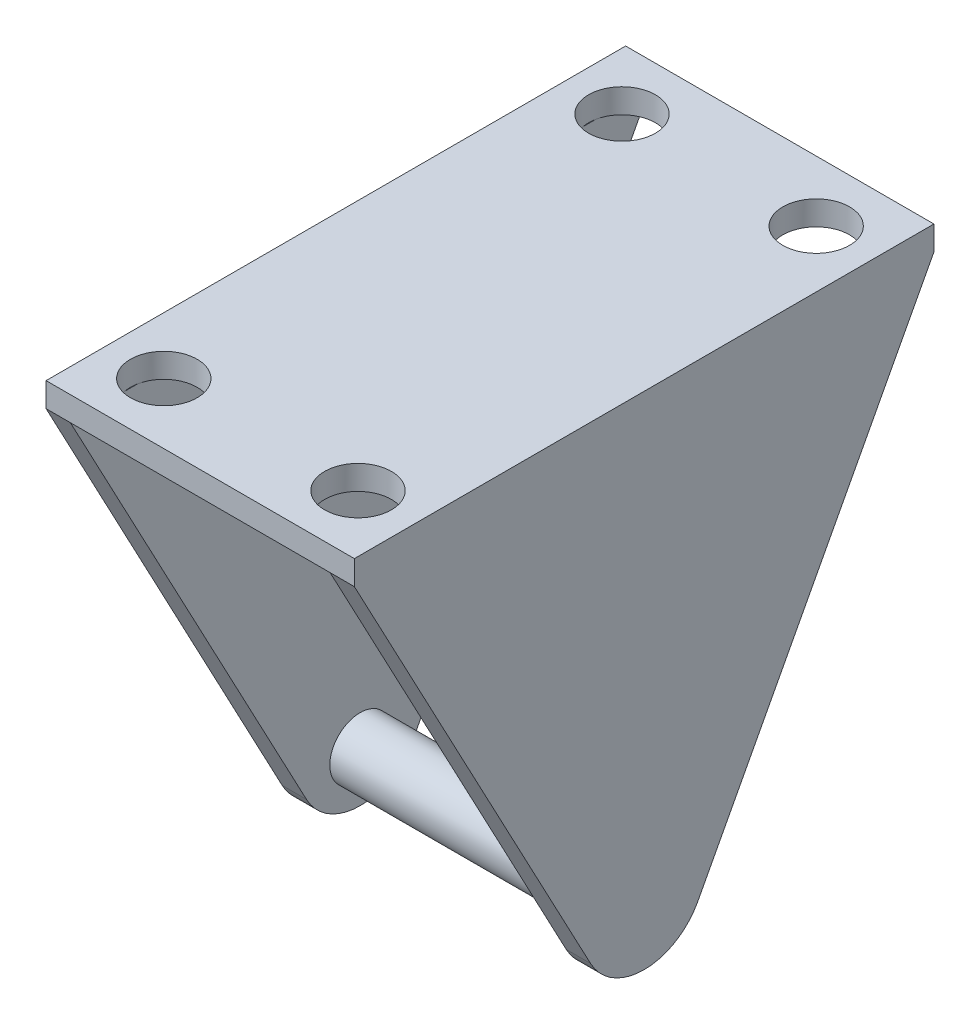
ISO-10303-21;
HEADER;
FILE_DESCRIPTION(('STEP AP214'),'2;1');
FILE_NAME('part.step','',(''),(''),'','','');
FILE_SCHEMA(('AUTOMOTIVE_DESIGN { 1 0 10303 214 1 1 1 1 }'));
ENDSEC;
DATA;
#1=APPLICATION_CONTEXT('core data for automotive mechanical design processes');
#2=APPLICATION_PROTOCOL_DEFINITION('international standard','automotive_design',2000,#1);
#3=PRODUCT_CONTEXT('',#1,'mechanical');
#4=PRODUCT('Part','Part','',(#3));
#5=PRODUCT_RELATED_PRODUCT_CATEGORY('part','',(#4));
#6=PRODUCT_DEFINITION_FORMATION('','',#4);
#7=PRODUCT_DEFINITION_CONTEXT('part definition',#1,'design');
#8=PRODUCT_DEFINITION('design','',#6,#7);
#9=PRODUCT_DEFINITION_SHAPE('','',#8);
#10=(LENGTH_UNIT() NAMED_UNIT(*) SI_UNIT(.MILLI.,.METRE.));
#11=(NAMED_UNIT(*) PLANE_ANGLE_UNIT() SI_UNIT($,.RADIAN.));
#12=(NAMED_UNIT(*) SI_UNIT($,.STERADIAN.) SOLID_ANGLE_UNIT());
#13=UNCERTAINTY_MEASURE_WITH_UNIT(LENGTH_MEASURE(1.E-05),#10,'distance_accuracy_value','');
#14=(GEOMETRIC_REPRESENTATION_CONTEXT(3) GLOBAL_UNCERTAINTY_ASSIGNED_CONTEXT((#13)) GLOBAL_UNIT_ASSIGNED_CONTEXT((#10,
#11,#12)) REPRESENTATION_CONTEXT('',''));
#15=CARTESIAN_POINT('',(0.,0.,0.));
#16=DIRECTION('',(0.,0.,1.));
#17=DIRECTION('',(1.,0.,0.));
#18=AXIS2_PLACEMENT_3D('',#15,#16,#17);
#19=CARTESIAN_POINT('',(10.7,-2.,47.752));
#20=DIRECTION('',(0.,1.,0.));
#21=DIRECTION('',(-1.,0.,0.));
#22=AXIS2_PLACEMENT_3D('',#19,#20,#21);
#23=PLANE('',#22);
#24=CARTESIAN_POINT('',(-8.,-2.,5.));
#25=DIRECTION('',(0.,1.,0.));
#26=DIRECTION('',(-1.,0.,0.));
#27=AXIS2_PLACEMENT_3D('',#24,#25,#26);
#28=CIRCLE('',#27,2.74999999999999);
#29=CARTESIAN_POINT('',(-10.7,-2.,4.47798467455454));
#30=VERTEX_POINT('',#29);
#31=CARTESIAN_POINT('',(-10.7,-2.,5.52201532544546));
#32=VERTEX_POINT('',#31);
#33=EDGE_CURVE('E56',#30,#32,#28,.F.);
#34=ORIENTED_EDGE('',*,*,#33,.F.);
#35=DIRECTION('',(0.,0.,-1.));
#36=VECTOR('',#35,1.);
#37=CARTESIAN_POINT('',(-10.7,-2.,47.752));
#38=LINE('',#37,#36);
#39=CARTESIAN_POINT('',(-10.7,-2.,0.));
#40=VERTEX_POINT('',#39);
#41=EDGE_CURVE('E152',#30,#40,#38,.T.);
#42=ORIENTED_EDGE('',*,*,#41,.T.);
#43=DIRECTION('',(1.,0.,0.));
#44=VECTOR('',#43,1.);
#45=CARTESIAN_POINT('',(10.7,-2.,0.));
#46=LINE('',#45,#44);
#47=CARTESIAN_POINT('',(10.7,-2.,0.));
#48=VERTEX_POINT('',#47);
#49=EDGE_CURVE('E267',#40,#48,#46,.T.);
#50=ORIENTED_EDGE('',*,*,#49,.T.);
#51=DIRECTION('',(0.,0.,-1.));
#52=VECTOR('',#51,1.);
#53=CARTESIAN_POINT('',(10.7,-2.,47.752));
#54=LINE('',#53,#52);
#55=CARTESIAN_POINT('',(10.7,-2.,4.47798467455453));
#56=VERTEX_POINT('',#55);
#57=EDGE_CURVE('E301',#56,#48,#54,.T.);
#58=ORIENTED_EDGE('',*,*,#57,.F.);
#59=CARTESIAN_POINT('',(8.,-2.,5.));
#60=DIRECTION('',(0.,1.,0.));
#61=DIRECTION('',(-1.,0.,0.));
#62=AXIS2_PLACEMENT_3D('',#59,#60,#61);
#63=CIRCLE('',#62,2.74999999999999);
#64=CARTESIAN_POINT('',(10.7,-2.,5.52201532544547));
#65=VERTEX_POINT('',#64);
#66=EDGE_CURVE('E48',#65,#56,#63,.F.);
#67=ORIENTED_EDGE('',*,*,#66,.F.);
#68=CARTESIAN_POINT('',(10.7,-2.,42.2299846745545));
#69=VERTEX_POINT('',#68);
#70=EDGE_CURVE('E175',#69,#65,#54,.T.);
#71=ORIENTED_EDGE('',*,*,#70,.F.);
#72=CARTESIAN_POINT('',(8.00000000000001,-2.,42.752));
#73=DIRECTION('',(0.,1.,0.));
#74=DIRECTION('',(-1.,0.,0.));
#75=AXIS2_PLACEMENT_3D('',#72,#73,#74);
#76=CIRCLE('',#75,2.74999999999999);
#77=CARTESIAN_POINT('',(10.7,-2.,43.2740153254455));
#78=VERTEX_POINT('',#77);
#79=EDGE_CURVE('E11',#78,#69,#76,.F.);
#80=ORIENTED_EDGE('',*,*,#79,.F.);
#81=CARTESIAN_POINT('',(10.7,-2.00000000000001,47.752));
#82=VERTEX_POINT('',#81);
#83=EDGE_CURVE('E169',#82,#78,#54,.T.);
#84=ORIENTED_EDGE('',*,*,#83,.F.);
#85=DIRECTION('',(1.,0.,0.));
#86=VECTOR('',#85,1.);
#87=CARTESIAN_POINT('',(10.7,-2.,47.752));
#88=LINE('',#87,#86);
#89=CARTESIAN_POINT('',(-10.7,-2.00000000000001,47.752));
#90=VERTEX_POINT('',#89);
#91=EDGE_CURVE('E268',#90,#82,#88,.T.);
#92=ORIENTED_EDGE('',*,*,#91,.F.);
#93=CARTESIAN_POINT('',(-10.7,-2.,43.2740153254454));
#94=VERTEX_POINT('',#93);
#95=EDGE_CURVE('E170',#90,#94,#38,.T.);
#96=ORIENTED_EDGE('',*,*,#95,.T.);
#97=CARTESIAN_POINT('',(-7.99999999999999,-2.,42.752));
#98=DIRECTION('',(0.,1.,0.));
#99=DIRECTION('',(-1.,0.,0.));
#100=AXIS2_PLACEMENT_3D('',#97,#98,#99);
#101=CIRCLE('',#100,2.74999999999999);
#102=CARTESIAN_POINT('',(-10.7,-2.,42.2299846745546));
#103=VERTEX_POINT('',#102);
#104=EDGE_CURVE('E63',#103,#94,#101,.F.);
#105=ORIENTED_EDGE('',*,*,#104,.F.);
#106=EDGE_CURVE('E151',#103,#32,#38,.T.);
#107=ORIENTED_EDGE('',*,*,#106,.T.);
#108=EDGE_LOOP('',(#34,#42,#50,#58,#67,#71,#80,#84,#92,#96,#105,#107));
#109=FACE_BOUND('',#108,.T.);
#110=ADVANCED_FACE('F38',(#109),#23,.F.);
#111=CARTESIAN_POINT('',(-12.7,0.,47.752));
#112=DIRECTION('',(0.,-1.,0.));
#113=DIRECTION('',(0.,0.,-1.));
#114=AXIS2_PLACEMENT_3D('',#111,#112,#113);
#115=PLANE('',#114);
#116=CARTESIAN_POINT('',(-8.,0.,5.));
#117=DIRECTION('',(0.,1.,0.));
#118=DIRECTION('',(0.,0.,1.));
#119=AXIS2_PLACEMENT_3D('',#116,#117,#118);
#120=CIRCLE('',#119,2.74999999999999);
#121=CARTESIAN_POINT('',(-8.,0.,7.74999999999999));
#122=VERTEX_POINT('',#121);
#123=EDGE_CURVE('E157',#122,#122,#120,.T.);
#124=ORIENTED_EDGE('',*,*,#123,.F.);
#125=EDGE_LOOP('',(#124));
#126=FACE_BOUND('',#125,.T.);
#127=CARTESIAN_POINT('',(-7.99999999999999,0.,42.752));
#128=DIRECTION('',(0.,1.,0.));
#129=DIRECTION('',(0.,0.,1.));
#130=AXIS2_PLACEMENT_3D('',#127,#128,#129);
#131=CIRCLE('',#130,2.74999999999999);
#132=CARTESIAN_POINT('',(-7.99999999999999,0.,45.502));
#133=VERTEX_POINT('',#132);
#134=EDGE_CURVE('E163',#133,#133,#131,.T.);
#135=ORIENTED_EDGE('',*,*,#134,.F.);
#136=EDGE_LOOP('',(#135));
#137=FACE_BOUND('',#136,.T.);
#138=CARTESIAN_POINT('',(8.00000000000001,0.,42.752));
#139=DIRECTION('',(0.,1.,0.));
#140=DIRECTION('',(0.,0.,1.));
#141=AXIS2_PLACEMENT_3D('',#138,#139,#140);
#142=CIRCLE('',#141,2.74999999999999);
#143=CARTESIAN_POINT('',(8.00000000000001,0.,45.502));
#144=VERTEX_POINT('',#143);
#145=EDGE_CURVE('E198',#144,#144,#142,.T.);
#146=ORIENTED_EDGE('',*,*,#145,.F.);
#147=EDGE_LOOP('',(#146));
#148=FACE_BOUND('',#147,.T.);
#149=DIRECTION('',(-1.,0.,0.));
#150=VECTOR('',#149,1.);
#151=CARTESIAN_POINT('',(-12.7,0.,0.));
#152=LINE('',#151,#150);
#153=CARTESIAN_POINT('',(12.7,0.,0.));
#154=VERTEX_POINT('',#153);
#155=CARTESIAN_POINT('',(-12.7,0.,0.));
#156=VERTEX_POINT('',#155);
#157=EDGE_CURVE('E289',#154,#156,#152,.T.);
#158=ORIENTED_EDGE('',*,*,#157,.T.);
#159=DIRECTION('',(0.,0.,-1.));
#160=VECTOR('',#159,1.);
#161=CARTESIAN_POINT('',(-12.7,0.,47.752));
#162=LINE('',#161,#160);
#163=CARTESIAN_POINT('',(-12.7,0.,47.752));
#164=VERTEX_POINT('',#163);
#165=EDGE_CURVE('E283',#164,#156,#162,.T.);
#166=ORIENTED_EDGE('',*,*,#165,.F.);
#167=DIRECTION('',(-1.,0.,0.));
#168=VECTOR('',#167,1.);
#169=CARTESIAN_POINT('',(-12.7,0.,47.752));
#170=LINE('',#169,#168);
#171=CARTESIAN_POINT('',(12.7,0.,47.752));
#172=VERTEX_POINT('',#171);
#173=EDGE_CURVE('E276',#172,#164,#170,.T.);
#174=ORIENTED_EDGE('',*,*,#173,.F.);
#175=DIRECTION('',(0.,0.,-1.));
#176=VECTOR('',#175,1.);
#177=CARTESIAN_POINT('',(12.7,0.,47.752));
#178=LINE('',#177,#176);
#179=EDGE_CURVE('E298',#172,#154,#178,.T.);
#180=ORIENTED_EDGE('',*,*,#179,.T.);
#181=EDGE_LOOP('',(#158,#166,#174,#180));
#182=FACE_BOUND('',#181,.T.);
#183=CARTESIAN_POINT('',(8.,0.,5.));
#184=DIRECTION('',(0.,1.,0.));
#185=DIRECTION('',(0.,0.,1.));
#186=AXIS2_PLACEMENT_3D('',#183,#184,#185);
#187=CIRCLE('',#186,2.74999999999999);
#188=CARTESIAN_POINT('',(8.,0.,7.74999999999999));
#189=VERTEX_POINT('',#188);
#190=EDGE_CURVE('E207',#189,#189,#187,.T.);
#191=ORIENTED_EDGE('',*,*,#190,.F.);
#192=EDGE_LOOP('',(#191));
#193=FACE_BOUND('',#192,.T.);
#194=ADVANCED_FACE('F386',(#126,#137,#148,#182,#193),#115,.F.);
#195=CARTESIAN_POINT('',(-10.7,-2.,47.752));
#196=DIRECTION('',(-1.,0.,0.));
#197=DIRECTION('',(0.,-1.,0.));
#198=AXIS2_PLACEMENT_3D('',#195,#196,#197);
#199=PLANE('',#198);
#200=CARTESIAN_POINT('',(-10.7,-37.1280044488068,23.876));
#201=DIRECTION('',(-1.,0.,0.));
#202=DIRECTION('',(0.,-1.,0.));
#203=AXIS2_PLACEMENT_3D('',#200,#201,#202);
#204=CIRCLE('',#203,2.5);
#205=CARTESIAN_POINT('',(-10.7,-39.6280044488068,23.876));
#206=VERTEX_POINT('',#205);
#207=EDGE_CURVE('E213',#206,#206,#204,.F.);
#208=ORIENTED_EDGE('',*,*,#207,.F.);
#209=EDGE_LOOP('',(#208));
#210=FACE_BOUND('',#209,.T.);
#211=DIRECTION('',(0.,-0.883059424984848,0.469261176686746));
#212=VECTOR('',#211,1.);
#213=CARTESIAN_POINT('',(-10.7,-21.7877366277267,10.5152793924982));
#214=LINE('',#213,#212);
#215=CARTESIAN_POINT('',(-10.7,-38.6213058834337,19.4607028750758));
#216=VERTEX_POINT('',#215);
#217=EDGE_CURVE('E166',#40,#216,#214,.T.);
#218=ORIENTED_EDGE('',*,*,#217,.F.);
#219=ORIENTED_EDGE('',*,*,#41,.F.);
#220=EDGE_CURVE('E143',#32,#30,#38,.T.);
#221=ORIENTED_EDGE('',*,*,#220,.F.);
#222=ORIENTED_EDGE('',*,*,#106,.F.);
#223=EDGE_CURVE('E181',#94,#103,#38,.T.);
#224=ORIENTED_EDGE('',*,*,#223,.F.);
#225=ORIENTED_EDGE('',*,*,#95,.F.);
#226=DIRECTION('',(0.,-0.883059424984848,-0.469261176686747));
#227=VECTOR('',#226,1.);
#228=CARTESIAN_POINT('',(-10.7,-2.,47.752));
#229=LINE('',#228,#227);
#230=CARTESIAN_POINT('',(-10.7,-38.6213058834337,28.2912971249242));
#231=VERTEX_POINT('',#230);
#232=EDGE_CURVE('E254',#90,#231,#229,.T.);
#233=ORIENTED_EDGE('',*,*,#232,.T.);
#234=CARTESIAN_POINT('',(-10.7,-36.275,23.876));
#235=DIRECTION('',(-1.,0.,0.));
#236=DIRECTION('',(0.,-1.,0.));
#237=AXIS2_PLACEMENT_3D('',#234,#235,#236);
#238=CIRCLE('',#237,4.99999999999999);
#239=EDGE_CURVE('E264',#216,#231,#238,.T.);
#240=ORIENTED_EDGE('',*,*,#239,.F.);
#241=EDGE_LOOP('',(#218,#219,#221,#222,#224,#225,#233,#240));
#242=FACE_BOUND('',#241,.T.);
#243=ADVANCED_FACE('F40',(#210,#242),#199,.F.);
#244=CARTESIAN_POINT('',(10.7,-41.275,47.752));
#245=DIRECTION('',(1.,0.,0.));
#246=DIRECTION('',(0.,0.,-1.));
#247=AXIS2_PLACEMENT_3D('',#244,#245,#246);
#248=PLANE('',#247);
#249=CARTESIAN_POINT('',(10.7,-37.1280044488068,23.876));
#250=DIRECTION('',(1.,0.,0.));
#251=DIRECTION('',(0.,0.,-1.));
#252=AXIS2_PLACEMENT_3D('',#249,#250,#251);
#253=CIRCLE('',#252,2.5);
#254=CARTESIAN_POINT('',(10.7,-37.1280044488068,21.376));
#255=VERTEX_POINT('',#254);
#256=EDGE_CURVE('E42',#255,#255,#253,.F.);
#257=ORIENTED_EDGE('',*,*,#256,.F.);
#258=EDGE_LOOP('',(#257));
#259=FACE_BOUND('',#258,.T.);
#260=DIRECTION('',(0.,0.883059424984848,-0.469261176686746));
#261=VECTOR('',#260,1.);
#262=CARTESIAN_POINT('',(10.7,-52.4141439375699,26.7902700955884));
#263=LINE('',#262,#261);
#264=CARTESIAN_POINT('',(10.7,-38.6213058834337,19.4607028750758));
#265=VERTEX_POINT('',#264);
#266=EDGE_CURVE('E236',#265,#48,#263,.T.);
#267=ORIENTED_EDGE('',*,*,#266,.F.);
#268=CARTESIAN_POINT('',(10.7,-36.275,23.876));
#269=DIRECTION('',(1.,0.,0.));
#270=DIRECTION('',(0.,0.,-1.));
#271=AXIS2_PLACEMENT_3D('',#268,#269,#270);
#272=CIRCLE('',#271,4.99999999999999);
#273=CARTESIAN_POINT('',(10.7,-38.6213058834337,28.2912971249242));
#274=VERTEX_POINT('',#273);
#275=EDGE_CURVE('E261',#274,#265,#272,.T.);
#276=ORIENTED_EDGE('',*,*,#275,.F.);
#277=DIRECTION('',(0.,0.883059424984848,0.469261176686747));
#278=VECTOR('',#277,1.);
#279=CARTESIAN_POINT('',(10.7,-32.6264073098432,31.4770092969098));
#280=LINE('',#279,#278);
#281=EDGE_CURVE('E250',#274,#82,#280,.T.);
#282=ORIENTED_EDGE('',*,*,#281,.T.);
#283=ORIENTED_EDGE('',*,*,#83,.T.);
#284=EDGE_CURVE('E173',#78,#69,#54,.T.);
#285=ORIENTED_EDGE('',*,*,#284,.T.);
#286=ORIENTED_EDGE('',*,*,#70,.T.);
#287=EDGE_CURVE('E176',#65,#56,#54,.T.);
#288=ORIENTED_EDGE('',*,*,#287,.T.);
#289=ORIENTED_EDGE('',*,*,#57,.T.);
#290=EDGE_LOOP('',(#267,#276,#282,#283,#285,#286,#288,#289));
#291=FACE_BOUND('',#290,.T.);
#292=ADVANCED_FACE('F317',(#259,#291),#248,.F.);
#293=CARTESIAN_POINT('',(12.7,0.,47.752));
#294=DIRECTION('',(-1.,0.,0.));
#295=DIRECTION('',(0.,-1.,0.));
#296=AXIS2_PLACEMENT_3D('',#293,#294,#295);
#297=PLANE('',#296);
#298=DIRECTION('',(0.,-0.883059424984848,0.469261176686746));
#299=VECTOR('',#298,1.);
#300=CARTESIAN_POINT('',(12.7,-20.2281487316175,9.68650838279274));
#301=LINE('',#300,#299);
#302=CARTESIAN_POINT('',(12.7,-2.,0.));
#303=VERTEX_POINT('',#302);
#304=CARTESIAN_POINT('',(12.7,-38.6213058834337,19.4607028750758));
#305=VERTEX_POINT('',#304);
#306=EDGE_CURVE('E233',#303,#305,#301,.T.);
#307=ORIENTED_EDGE('',*,*,#306,.F.);
#308=DIRECTION('',(0.,1.,0.));
#309=VECTOR('',#308,1.);
#310=CARTESIAN_POINT('',(12.7,0.,0.));
#311=LINE('',#310,#309);
#312=EDGE_CURVE('E286',#303,#154,#311,.T.);
#313=ORIENTED_EDGE('',*,*,#312,.T.);
#314=ORIENTED_EDGE('',*,*,#179,.F.);
#315=DIRECTION('',(0.,1.,0.));
#316=VECTOR('',#315,1.);
#317=CARTESIAN_POINT('',(12.7,0.,47.752));
#318=LINE('',#317,#316);
#319=CARTESIAN_POINT('',(12.7,-2.00000000000001,47.752));
#320=VERTEX_POINT('',#319);
#321=EDGE_CURVE('E272',#320,#172,#318,.T.);
#322=ORIENTED_EDGE('',*,*,#321,.F.);
#323=DIRECTION('',(0.,-0.883059424984848,-0.469261176686747));
#324=VECTOR('',#323,1.);
#325=CARTESIAN_POINT('',(12.7,-0.440412103890865,48.5807710097054));
#326=LINE('',#325,#324);
#327=CARTESIAN_POINT('',(12.7,-38.6213058834337,28.2912971249242));
#328=VERTEX_POINT('',#327);
#329=EDGE_CURVE('E246',#320,#328,#326,.T.);
#330=ORIENTED_EDGE('',*,*,#329,.T.);
#331=CARTESIAN_POINT('',(12.7,-36.275,23.876));
#332=DIRECTION('',(-1.,0.,0.));
#333=DIRECTION('',(0.,-1.,0.));
#334=AXIS2_PLACEMENT_3D('',#331,#332,#333);
#335=CIRCLE('',#334,4.99999999999999);
#336=EDGE_CURVE('E258',#305,#328,#335,.T.);
#337=ORIENTED_EDGE('',*,*,#336,.F.);
#338=EDGE_LOOP('',(#307,#313,#314,#322,#330,#337));
#339=FACE_BOUND('',#338,.T.);
#340=ADVANCED_FACE('F358',(#339),#297,.F.);
#341=CARTESIAN_POINT('',(-12.7,-41.275,47.752));
#342=DIRECTION('',(1.,0.,0.));
#343=DIRECTION('',(0.,0.,-1.));
#344=AXIS2_PLACEMENT_3D('',#341,#342,#343);
#345=PLANE('',#344);
#346=DIRECTION('',(0.,0.883059424984848,-0.469261176686746));
#347=VECTOR('',#346,1.);
#348=CARTESIAN_POINT('',(-12.7,-52.4141439375699,26.7902700955884));
#349=LINE('',#348,#347);
#350=CARTESIAN_POINT('',(-12.7,-38.6213058834337,19.4607028750758));
#351=VERTEX_POINT('',#350);
#352=CARTESIAN_POINT('',(-12.7,-2.,0.));
#353=VERTEX_POINT('',#352);
#354=EDGE_CURVE('E230',#351,#353,#349,.T.);
#355=ORIENTED_EDGE('',*,*,#354,.F.);
#356=CARTESIAN_POINT('',(-12.7,-36.275,23.876));
#357=DIRECTION('',(1.,0.,0.));
#358=DIRECTION('',(0.,0.,-1.));
#359=AXIS2_PLACEMENT_3D('',#356,#357,#358);
#360=CIRCLE('',#359,4.99999999999999);
#361=CARTESIAN_POINT('',(-12.7,-38.6213058834337,28.2912971249242));
#362=VERTEX_POINT('',#361);
#363=EDGE_CURVE('E330',#362,#351,#360,.T.);
#364=ORIENTED_EDGE('',*,*,#363,.F.);
#365=DIRECTION('',(0.,0.883059424984848,0.469261176686747));
#366=VECTOR('',#365,1.);
#367=CARTESIAN_POINT('',(-12.7,-32.6264073098432,31.4770092969098));
#368=LINE('',#367,#366);
#369=CARTESIAN_POINT('',(-12.7,-2.00000000000001,47.752));
#370=VERTEX_POINT('',#369);
#371=EDGE_CURVE('E242',#362,#370,#368,.T.);
#372=ORIENTED_EDGE('',*,*,#371,.T.);
#373=DIRECTION('',(0.,-1.,0.));
#374=VECTOR('',#373,1.);
#375=CARTESIAN_POINT('',(-12.7,-41.275,47.752));
#376=LINE('',#375,#374);
#377=EDGE_CURVE('E279',#164,#370,#376,.T.);
#378=ORIENTED_EDGE('',*,*,#377,.F.);
#379=ORIENTED_EDGE('',*,*,#165,.T.);
#380=DIRECTION('',(0.,-1.,0.));
#381=VECTOR('',#380,1.);
#382=CARTESIAN_POINT('',(-12.7,-41.275,0.));
#383=LINE('',#382,#381);
#384=EDGE_CURVE('E273',#156,#353,#383,.T.);
#385=ORIENTED_EDGE('',*,*,#384,.T.);
#386=EDGE_LOOP('',(#355,#364,#372,#378,#379,#385));
#387=FACE_BOUND('',#386,.T.);
#388=ADVANCED_FACE('F398',(#387),#345,.F.);
#389=CARTESIAN_POINT('',(0.,0.,0.));
#390=DIRECTION('',(0.,0.,-1.));
#391=DIRECTION('',(-1.,0.,0.));
#392=AXIS2_PLACEMENT_3D('',#389,#390,#391);
#393=PLANE('',#392);
#394=ORIENTED_EDGE('',*,*,#312,.F.);
#395=DIRECTION('',(-1.,0.,0.));
#396=VECTOR('',#395,1.);
#397=CARTESIAN_POINT('',(0.,-2.,0.));
#398=LINE('',#397,#396);
#399=EDGE_CURVE('E187',#303,#48,#398,.T.);
#400=ORIENTED_EDGE('',*,*,#399,.T.);
#401=ORIENTED_EDGE('',*,*,#49,.F.);
#402=EDGE_CURVE('E180',#40,#353,#398,.T.);
#403=ORIENTED_EDGE('',*,*,#402,.T.);
#404=ORIENTED_EDGE('',*,*,#384,.F.);
#405=ORIENTED_EDGE('',*,*,#157,.F.);
#406=EDGE_LOOP('',(#394,#400,#401,#403,#404,#405));
#407=FACE_BOUND('',#406,.T.);
#408=ADVANCED_FACE('F350',(#407),#393,.T.);
#409=CARTESIAN_POINT('',(0.,0.,47.752));
#410=DIRECTION('',(0.,0.,-1.));
#411=DIRECTION('',(-1.,0.,0.));
#412=AXIS2_PLACEMENT_3D('',#409,#410,#411);
#413=PLANE('',#412);
#414=ORIENTED_EDGE('',*,*,#377,.T.);
#415=DIRECTION('',(1.,0.,0.));
#416=VECTOR('',#415,1.);
#417=CARTESIAN_POINT('',(0.,-2.00000000000002,47.752));
#418=LINE('',#417,#416);
#419=EDGE_CURVE('E334',#370,#90,#418,.T.);
#420=ORIENTED_EDGE('',*,*,#419,.T.);
#421=ORIENTED_EDGE('',*,*,#91,.T.);
#422=EDGE_CURVE('E340',#82,#320,#418,.T.);
#423=ORIENTED_EDGE('',*,*,#422,.T.);
#424=ORIENTED_EDGE('',*,*,#321,.T.);
#425=ORIENTED_EDGE('',*,*,#173,.T.);
#426=EDGE_LOOP('',(#414,#420,#421,#423,#424,#425));
#427=FACE_BOUND('',#426,.T.);
#428=ADVANCED_FACE('F369',(#427),#413,.F.);
#429=CARTESIAN_POINT('',(47.752,-20.2281487316175,38.0654916172073));
#430=DIRECTION('',(0.,0.469261176686747,-0.883059424984848));
#431=DIRECTION('',(0.,0.883059424984848,0.469261176686747));
#432=AXIS2_PLACEMENT_3D('',#429,#430,#431);
#433=PLANE('',#432);
#434=ORIENTED_EDGE('',*,*,#419,.F.);
#435=ORIENTED_EDGE('',*,*,#371,.F.);
#436=DIRECTION('',(-1.,0.,0.));
#437=VECTOR('',#436,1.);
#438=CARTESIAN_POINT('',(47.752,-38.6213058834337,28.2912971249242));
#439=LINE('',#438,#437);
#440=EDGE_CURVE('E220',#231,#362,#439,.T.);
#441=ORIENTED_EDGE('',*,*,#440,.F.);
#442=ORIENTED_EDGE('',*,*,#232,.F.);
#443=EDGE_LOOP('',(#434,#435,#441,#442));
#444=FACE_BOUND('',#443,.T.);
#445=ADVANCED_FACE('F407',(#444),#433,.F.);
#446=CARTESIAN_POINT('',(47.752,-0.44041210389086,-0.828771009705423));
#447=DIRECTION('',(0.,-0.469261176686746,-0.883059424984848));
#448=DIRECTION('',(0.,0.883059424984848,-0.469261176686746));
#449=AXIS2_PLACEMENT_3D('',#446,#447,#448);
#450=PLANE('',#449);
#451=ORIENTED_EDGE('',*,*,#217,.T.);
#452=DIRECTION('',(-1.,0.,0.));
#453=VECTOR('',#452,1.);
#454=CARTESIAN_POINT('',(47.752,-38.6213058834337,19.4607028750758));
#455=LINE('',#454,#453);
#456=EDGE_CURVE('E225',#216,#351,#455,.T.);
#457=ORIENTED_EDGE('',*,*,#456,.T.);
#458=ORIENTED_EDGE('',*,*,#354,.T.);
#459=ORIENTED_EDGE('',*,*,#402,.F.);
#460=EDGE_LOOP('',(#451,#457,#458,#459));
#461=FACE_BOUND('',#460,.T.);
#462=ADVANCED_FACE('F408',(#461),#450,.T.);
#463=CARTESIAN_POINT('',(47.752,-36.275,23.876));
#464=DIRECTION('',(-1.,0.,0.));
#465=DIRECTION('',(0.,0.,1.));
#466=AXIS2_PLACEMENT_3D('',#463,#464,#465);
#467=CYLINDRICAL_SURFACE('',#466,4.99999999999999);
#468=ORIENTED_EDGE('',*,*,#239,.T.);
#469=ORIENTED_EDGE('',*,*,#440,.T.);
#470=ORIENTED_EDGE('',*,*,#363,.T.);
#471=ORIENTED_EDGE('',*,*,#456,.F.);
#472=EDGE_LOOP('',(#468,#469,#470,#471));
#473=FACE_BOUND('',#472,.T.);
#474=ADVANCED_FACE('F411',(#473),#467,.T.);
#475=ORIENTED_EDGE('',*,*,#275,.T.);
#476=EDGE_CURVE('E229',#305,#265,#455,.T.);
#477=ORIENTED_EDGE('',*,*,#476,.F.);
#478=ORIENTED_EDGE('',*,*,#336,.T.);
#479=EDGE_CURVE('E224',#328,#274,#439,.T.);
#480=ORIENTED_EDGE('',*,*,#479,.T.);
#481=EDGE_LOOP('',(#475,#477,#478,#480));
#482=FACE_BOUND('',#481,.T.);
#483=ADVANCED_FACE('F362',(#482),#467,.T.);
#484=ORIENTED_EDGE('',*,*,#479,.F.);
#485=ORIENTED_EDGE('',*,*,#329,.F.);
#486=ORIENTED_EDGE('',*,*,#422,.F.);
#487=ORIENTED_EDGE('',*,*,#281,.F.);
#488=EDGE_LOOP('',(#484,#485,#486,#487));
#489=FACE_BOUND('',#488,.T.);
#490=ADVANCED_FACE('F365',(#489),#433,.F.);
#491=ORIENTED_EDGE('',*,*,#266,.T.);
#492=ORIENTED_EDGE('',*,*,#399,.F.);
#493=ORIENTED_EDGE('',*,*,#306,.T.);
#494=ORIENTED_EDGE('',*,*,#476,.T.);
#495=EDGE_LOOP('',(#491,#492,#493,#494));
#496=FACE_BOUND('',#495,.T.);
#497=ADVANCED_FACE('F353',(#496),#450,.T.);
#498=CARTESIAN_POINT('',(-17.7710678118655,-37.1280044488068,23.876));
#499=DIRECTION('',(1.,0.,0.));
#500=DIRECTION('',(0.,0.,-1.));
#501=AXIS2_PLACEMENT_3D('',#498,#499,#500);
#502=CYLINDRICAL_SURFACE('',#501,2.5);
#503=ORIENTED_EDGE('',*,*,#207,.T.);
#504=EDGE_LOOP('',(#503));
#505=FACE_BOUND('',#504,.T.);
#506=ORIENTED_EDGE('',*,*,#256,.T.);
#507=EDGE_LOOP('',(#506));
#508=FACE_BOUND('',#507,.T.);
#509=ADVANCED_FACE('F418',(#505,#508),#502,.T.);
#510=CARTESIAN_POINT('',(10.7,-2.,47.752));
#511=DIRECTION('',(0.,1.,0.));
#512=DIRECTION('',(-1.,0.,0.));
#513=AXIS2_PLACEMENT_3D('',#510,#511,#512);
#514=PLANE('',#513);
#515=ORIENTED_EDGE('',*,*,#287,.F.);
#516=EDGE_CURVE('E209',#56,#65,#63,.F.);
#517=ORIENTED_EDGE('',*,*,#516,.F.);
#518=EDGE_LOOP('',(#515,#517));
#519=FACE_BOUND('',#518,.T.);
#520=ADVANCED_FACE('F326',(#519),#514,.T.);
#521=CARTESIAN_POINT('',(8.,0.,5.));
#522=DIRECTION('',(0.,1.,0.));
#523=DIRECTION('',(0.,0.,1.));
#524=AXIS2_PLACEMENT_3D('',#521,#522,#523);
#525=CYLINDRICAL_SURFACE('',#524,2.74999999999999);
#526=ORIENTED_EDGE('',*,*,#516,.T.);
#527=ORIENTED_EDGE('',*,*,#66,.T.);
#528=EDGE_LOOP('',(#526,#527));
#529=FACE_BOUND('',#528,.T.);
#530=ORIENTED_EDGE('',*,*,#190,.T.);
#531=EDGE_LOOP('',(#530));
#532=FACE_BOUND('',#531,.T.);
#533=ADVANCED_FACE('F323',(#529,#532),#525,.F.);
#534=CARTESIAN_POINT('',(10.7,-2.,47.752));
#535=DIRECTION('',(0.,1.,0.));
#536=DIRECTION('',(-1.,0.,0.));
#537=AXIS2_PLACEMENT_3D('',#534,#535,#536);
#538=PLANE('',#537);
#539=ORIENTED_EDGE('',*,*,#284,.F.);
#540=EDGE_CURVE('E50',#69,#78,#76,.F.);
#541=ORIENTED_EDGE('',*,*,#540,.F.);
#542=EDGE_LOOP('',(#539,#541));
#543=FACE_BOUND('',#542,.T.);
#544=ADVANCED_FACE('F375',(#543),#538,.T.);
#545=CARTESIAN_POINT('',(8.00000000000001,0.,42.752));
#546=DIRECTION('',(0.,1.,0.));
#547=DIRECTION('',(0.,0.,1.));
#548=AXIS2_PLACEMENT_3D('',#545,#546,#547);
#549=CYLINDRICAL_SURFACE('',#548,2.74999999999999);
#550=ORIENTED_EDGE('',*,*,#540,.T.);
#551=ORIENTED_EDGE('',*,*,#79,.T.);
#552=EDGE_LOOP('',(#550,#551));
#553=FACE_BOUND('',#552,.T.);
#554=ORIENTED_EDGE('',*,*,#145,.T.);
#555=EDGE_LOOP('',(#554));
#556=FACE_BOUND('',#555,.T.);
#557=ADVANCED_FACE('F372',(#553,#556),#549,.F.);
#558=CARTESIAN_POINT('',(10.7,-2.,47.752));
#559=DIRECTION('',(0.,1.,0.));
#560=DIRECTION('',(-1.,0.,0.));
#561=AXIS2_PLACEMENT_3D('',#558,#559,#560);
#562=PLANE('',#561);
#563=ORIENTED_EDGE('',*,*,#223,.T.);
#564=EDGE_CURVE('E192',#94,#103,#101,.F.);
#565=ORIENTED_EDGE('',*,*,#564,.F.);
#566=EDGE_LOOP('',(#563,#565));
#567=FACE_BOUND('',#566,.T.);
#568=ADVANCED_FACE('F191',(#567),#562,.T.);
#569=CARTESIAN_POINT('',(-7.99999999999999,0.,42.752));
#570=DIRECTION('',(0.,1.,0.));
#571=DIRECTION('',(0.,0.,1.));
#572=AXIS2_PLACEMENT_3D('',#569,#570,#571);
#573=CYLINDRICAL_SURFACE('',#572,2.74999999999999);
#574=ORIENTED_EDGE('',*,*,#104,.T.);
#575=ORIENTED_EDGE('',*,*,#564,.T.);
#576=EDGE_LOOP('',(#574,#575));
#577=FACE_BOUND('',#576,.T.);
#578=ORIENTED_EDGE('',*,*,#134,.T.);
#579=EDGE_LOOP('',(#578));
#580=FACE_BOUND('',#579,.T.);
#581=ADVANCED_FACE('F193',(#577,#580),#573,.F.);
#582=CARTESIAN_POINT('',(10.7,-2.,47.752));
#583=DIRECTION('',(0.,1.,0.));
#584=DIRECTION('',(-1.,0.,0.));
#585=AXIS2_PLACEMENT_3D('',#582,#583,#584);
#586=PLANE('',#585);
#587=ORIENTED_EDGE('',*,*,#220,.T.);
#588=EDGE_CURVE('E145',#32,#30,#28,.F.);
#589=ORIENTED_EDGE('',*,*,#588,.F.);
#590=EDGE_LOOP('',(#587,#589));
#591=FACE_BOUND('',#590,.T.);
#592=ADVANCED_FACE('F144',(#591),#586,.T.);
#593=CARTESIAN_POINT('',(-8.,0.,5.));
#594=DIRECTION('',(0.,1.,0.));
#595=DIRECTION('',(0.,0.,1.));
#596=AXIS2_PLACEMENT_3D('',#593,#594,#595);
#597=CYLINDRICAL_SURFACE('',#596,2.74999999999999);
#598=ORIENTED_EDGE('',*,*,#33,.T.);
#599=ORIENTED_EDGE('',*,*,#588,.T.);
#600=EDGE_LOOP('',(#598,#599));
#601=FACE_BOUND('',#600,.T.);
#602=ORIENTED_EDGE('',*,*,#123,.T.);
#603=EDGE_LOOP('',(#602));
#604=FACE_BOUND('',#603,.T.);
#605=ADVANCED_FACE('F154',(#601,#604),#597,.F.);
#606=CLOSED_SHELL('',(#110,#194,#243,#292,#340,#388,#408,#428,#445,#462,#474,#483,#490,#497,
#509,#520,#533,#544,#557,#568,#581,#592,#605));
#607=MANIFOLD_SOLID_BREP('B2',#606);
#608=ADVANCED_BREP_SHAPE_REPRESENTATION('',(#18,#607),#14);
#609=SHAPE_DEFINITION_REPRESENTATION(#9,#608);
ENDSEC;
END-ISO-10303-21;
